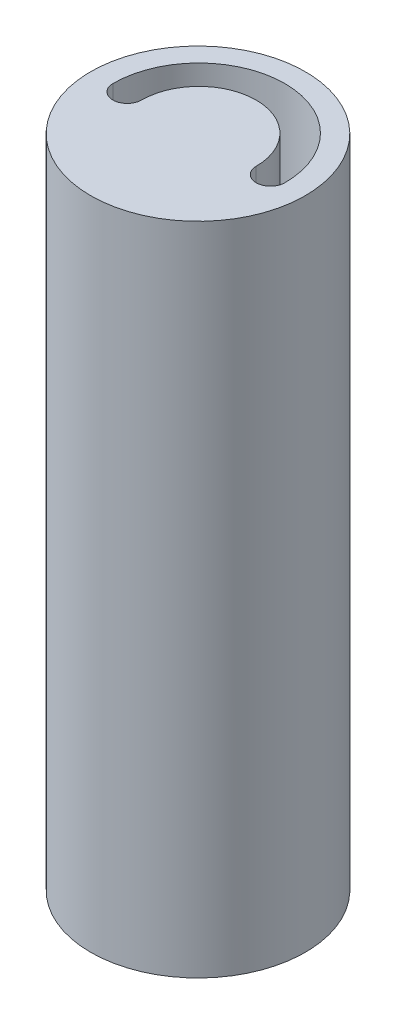
ISO-10303-21;
HEADER;
FILE_DESCRIPTION(('STEP AP214'),'2;1');
FILE_NAME('part.step','',(''),(''),'','','');
FILE_SCHEMA(('AUTOMOTIVE_DESIGN { 1 0 10303 214 1 1 1 1 }'));
ENDSEC;
DATA;
#1=APPLICATION_CONTEXT('core data for automotive mechanical design processes');
#2=APPLICATION_PROTOCOL_DEFINITION('international standard','automotive_design',2000,#1);
#3=PRODUCT_CONTEXT('',#1,'mechanical');
#4=PRODUCT('Part','Part','',(#3));
#5=PRODUCT_RELATED_PRODUCT_CATEGORY('part','',(#4));
#6=PRODUCT_DEFINITION_FORMATION('','',#4);
#7=PRODUCT_DEFINITION_CONTEXT('part definition',#1,'design');
#8=PRODUCT_DEFINITION('design','',#6,#7);
#9=PRODUCT_DEFINITION_SHAPE('','',#8);
#10=(LENGTH_UNIT() NAMED_UNIT(*) SI_UNIT(.MILLI.,.METRE.));
#11=(NAMED_UNIT(*) PLANE_ANGLE_UNIT() SI_UNIT($,.RADIAN.));
#12=(NAMED_UNIT(*) SI_UNIT($,.STERADIAN.) SOLID_ANGLE_UNIT());
#13=UNCERTAINTY_MEASURE_WITH_UNIT(LENGTH_MEASURE(1.E-05),#10,'distance_accuracy_value','');
#14=(GEOMETRIC_REPRESENTATION_CONTEXT(3) GLOBAL_UNCERTAINTY_ASSIGNED_CONTEXT((#13)) GLOBAL_UNIT_ASSIGNED_CONTEXT((#10,
#11,#12)) REPRESENTATION_CONTEXT('',''));
#15=CARTESIAN_POINT('',(0.,0.,0.));
#16=DIRECTION('',(0.,0.,1.));
#17=DIRECTION('',(1.,0.,0.));
#18=AXIS2_PLACEMENT_3D('',#15,#16,#17);
#19=CARTESIAN_POINT('',(0.,-349.6,-28.1));
#20=DIRECTION('',(0.,1.,0.));
#21=DIRECTION('',(0.,0.,1.));
#22=AXIS2_PLACEMENT_3D('',#19,#20,#21);
#23=CYLINDRICAL_SURFACE('',#22,28.1);
#24=CARTESIAN_POINT('',(0.,-349.6,-28.1));
#25=DIRECTION('',(0.,-1.,0.));
#26=DIRECTION('',(0.,0.,-1.));
#27=AXIS2_PLACEMENT_3D('',#24,#25,#26);
#28=CIRCLE('',#27,28.1);
#29=CARTESIAN_POINT('',(0.,-349.6,-56.2));
#30=VERTEX_POINT('',#29);
#31=EDGE_CURVE('E175',#30,#30,#28,.T.);
#32=ORIENTED_EDGE('',*,*,#31,.F.);
#33=EDGE_LOOP('',(#32));
#34=FACE_BOUND('',#33,.T.);
#35=CARTESIAN_POINT('',(0.,-178.1,-28.1));
#36=DIRECTION('',(0.,1.,0.));
#37=DIRECTION('',(0.,0.,1.));
#38=AXIS2_PLACEMENT_3D('',#35,#36,#37);
#39=CIRCLE('',#38,28.1);
#40=CARTESIAN_POINT('',(0.,-178.1,0.));
#41=VERTEX_POINT('',#40);
#42=EDGE_CURVE('E225',#41,#41,#39,.T.);
#43=ORIENTED_EDGE('',*,*,#42,.F.);
#44=EDGE_LOOP('',(#43));
#45=FACE_BOUND('',#44,.T.);
#46=ADVANCED_FACE('F39',(#34,#45),#23,.T.);
#47=CARTESIAN_POINT('',(0.,-349.6,-28.3320788958154));
#48=DIRECTION('',(0.,-1.,0.));
#49=DIRECTION('',(0.,0.,-1.));
#50=AXIS2_PLACEMENT_3D('',#47,#48,#49);
#51=CYLINDRICAL_SURFACE('',#50,15.);
#52=DIRECTION('',(0.,1.,0.));
#53=VECTOR('',#52,1.);
#54=CARTESIAN_POINT('',(-15.,-349.6,-28.3320788958154));
#55=LINE('',#54,#53);
#56=CARTESIAN_POINT('',(-15.,-349.6,-28.3320788958154));
#57=VERTEX_POINT('',#56);
#58=CARTESIAN_POINT('',(-15.,-178.1,-28.3320788958154));
#59=VERTEX_POINT('',#58);
#60=EDGE_CURVE('E115',#57,#59,#55,.T.);
#61=ORIENTED_EDGE('',*,*,#60,.T.);
#62=CARTESIAN_POINT('',(0.,-178.1,-28.3320788958154));
#63=DIRECTION('',(0.,1.,0.));
#64=DIRECTION('',(0.,0.,1.));
#65=AXIS2_PLACEMENT_3D('',#62,#63,#64);
#66=CIRCLE('',#65,15.);
#67=CARTESIAN_POINT('',(15.,-178.1,-28.3320788958154));
#68=VERTEX_POINT('',#67);
#69=EDGE_CURVE('E103',#59,#68,#66,.F.);
#70=ORIENTED_EDGE('',*,*,#69,.T.);
#71=DIRECTION('',(0.,1.,0.));
#72=VECTOR('',#71,1.);
#73=CARTESIAN_POINT('',(15.,-349.6,-28.3320788958154));
#74=LINE('',#73,#72);
#75=CARTESIAN_POINT('',(15.,-349.6,-28.3320788958154));
#76=VERTEX_POINT('',#75);
#77=EDGE_CURVE('E113',#76,#68,#74,.T.);
#78=ORIENTED_EDGE('',*,*,#77,.F.);
#79=CARTESIAN_POINT('',(0.,-349.6,-28.3320788958154));
#80=DIRECTION('',(0.,-1.,0.));
#81=DIRECTION('',(-1.,0.,0.));
#82=AXIS2_PLACEMENT_3D('',#79,#80,#81);
#83=CIRCLE('',#82,15.);
#84=EDGE_CURVE('E124',#57,#76,#83,.T.);
#85=ORIENTED_EDGE('',*,*,#84,.F.);
#86=EDGE_LOOP('',(#61,#70,#78,#85));
#87=FACE_BOUND('',#86,.T.);
#88=ADVANCED_FACE('F111',(#87),#51,.T.);
#89=CARTESIAN_POINT('',(0.,-349.6,-28.3320788958154));
#90=DIRECTION('',(0.,-1.,0.));
#91=DIRECTION('',(0.,0.,-1.));
#92=AXIS2_PLACEMENT_3D('',#89,#90,#91);
#93=CYLINDRICAL_SURFACE('',#92,22.5);
#94=DIRECTION('',(0.,-1.,0.));
#95=VECTOR('',#94,1.);
#96=CARTESIAN_POINT('',(22.5,-349.6,-28.3320788958154));
#97=LINE('',#96,#95);
#98=CARTESIAN_POINT('',(22.5,-178.1,-28.3320788958154));
#99=VERTEX_POINT('',#98);
#100=CARTESIAN_POINT('',(22.5,-349.6,-28.3320788958154));
#101=VERTEX_POINT('',#100);
#102=EDGE_CURVE('E123',#99,#101,#97,.T.);
#103=ORIENTED_EDGE('',*,*,#102,.F.);
#104=CARTESIAN_POINT('',(0.,-178.1,-28.3320788958154));
#105=DIRECTION('',(0.,1.,0.));
#106=DIRECTION('',(0.,0.,1.));
#107=AXIS2_PLACEMENT_3D('',#104,#105,#106);
#108=CIRCLE('',#107,22.5);
#109=CARTESIAN_POINT('',(-22.5,-178.1,-28.3320788958154));
#110=VERTEX_POINT('',#109);
#111=EDGE_CURVE('E53',#99,#110,#108,.T.);
#112=ORIENTED_EDGE('',*,*,#111,.T.);
#113=DIRECTION('',(0.,-1.,0.));
#114=VECTOR('',#113,1.);
#115=CARTESIAN_POINT('',(-22.5,-349.6,-28.3320788958154));
#116=LINE('',#115,#114);
#117=CARTESIAN_POINT('',(-22.5,-349.6,-28.3320788958154));
#118=VERTEX_POINT('',#117);
#119=EDGE_CURVE('E60',#110,#118,#116,.T.);
#120=ORIENTED_EDGE('',*,*,#119,.T.);
#121=CARTESIAN_POINT('',(0.,-349.6,-28.3320788958154));
#122=DIRECTION('',(0.,-1.,0.));
#123=DIRECTION('',(-1.,0.,0.));
#124=AXIS2_PLACEMENT_3D('',#121,#122,#123);
#125=CIRCLE('',#124,22.5);
#126=EDGE_CURVE('E128',#118,#101,#125,.T.);
#127=ORIENTED_EDGE('',*,*,#126,.T.);
#128=EDGE_LOOP('',(#103,#112,#120,#127));
#129=FACE_BOUND('',#128,.T.);
#130=ADVANCED_FACE('F219',(#129),#93,.F.);
#131=CARTESIAN_POINT('',(-18.75,-24.6,-28.3320788958154));
#132=DIRECTION('',(0.,-1.,0.));
#133=DIRECTION('',(0.,0.,-1.));
#134=AXIS2_PLACEMENT_3D('',#131,#132,#133);
#135=CYLINDRICAL_SURFACE('',#134,3.75);
#136=CARTESIAN_POINT('',(-18.75,-178.1,-28.3320788958154));
#137=DIRECTION('',(0.,1.,0.));
#138=DIRECTION('',(0.,0.,1.));
#139=AXIS2_PLACEMENT_3D('',#136,#137,#138);
#140=CIRCLE('',#139,3.75);
#141=EDGE_CURVE('E117',#59,#110,#140,.F.);
#142=ORIENTED_EDGE('',*,*,#141,.F.);
#143=ORIENTED_EDGE('',*,*,#60,.F.);
#144=CARTESIAN_POINT('',(-18.75,-349.6,-28.3320788958154));
#145=DIRECTION('',(0.,-1.,0.));
#146=DIRECTION('',(0.,0.,-1.));
#147=AXIS2_PLACEMENT_3D('',#144,#145,#146);
#148=CIRCLE('',#147,3.75);
#149=EDGE_CURVE('E233',#57,#118,#148,.T.);
#150=ORIENTED_EDGE('',*,*,#149,.T.);
#151=ORIENTED_EDGE('',*,*,#119,.F.);
#152=EDGE_LOOP('',(#142,#143,#150,#151));
#153=FACE_BOUND('',#152,.T.);
#154=ADVANCED_FACE('F239',(#153),#135,.F.);
#155=CARTESIAN_POINT('',(18.75,-24.6,-28.3320788958154));
#156=DIRECTION('',(0.,-1.,0.));
#157=DIRECTION('',(0.,0.,-1.));
#158=AXIS2_PLACEMENT_3D('',#155,#156,#157);
#159=CYLINDRICAL_SURFACE('',#158,3.75);
#160=CARTESIAN_POINT('',(18.75,-178.1,-28.3320788958154));
#161=DIRECTION('',(0.,1.,0.));
#162=DIRECTION('',(0.,0.,1.));
#163=AXIS2_PLACEMENT_3D('',#160,#161,#162);
#164=CIRCLE('',#163,3.75);
#165=EDGE_CURVE('E11',#99,#68,#164,.F.);
#166=ORIENTED_EDGE('',*,*,#165,.F.);
#167=ORIENTED_EDGE('',*,*,#102,.T.);
#168=CARTESIAN_POINT('',(18.75,-349.6,-28.3320788958154));
#169=DIRECTION('',(0.,-1.,0.));
#170=DIRECTION('',(0.,0.,-1.));
#171=AXIS2_PLACEMENT_3D('',#168,#169,#170);
#172=CIRCLE('',#171,3.75);
#173=EDGE_CURVE('E121',#101,#76,#172,.T.);
#174=ORIENTED_EDGE('',*,*,#173,.T.);
#175=ORIENTED_EDGE('',*,*,#77,.T.);
#176=EDGE_LOOP('',(#166,#167,#174,#175));
#177=FACE_BOUND('',#176,.T.);
#178=ADVANCED_FACE('F119',(#177),#159,.F.);
#179=CARTESIAN_POINT('',(0.,-349.6,-28.1));
#180=DIRECTION('',(0.,-1.,0.));
#181=DIRECTION('',(0.,0.,-1.));
#182=AXIS2_PLACEMENT_3D('',#179,#180,#181);
#183=PLANE('',#182);
#184=ORIENTED_EDGE('',*,*,#173,.F.);
#185=ORIENTED_EDGE('',*,*,#126,.F.);
#186=ORIENTED_EDGE('',*,*,#149,.F.);
#187=ORIENTED_EDGE('',*,*,#84,.T.);
#188=EDGE_LOOP('',(#184,#185,#186,#187));
#189=FACE_BOUND('',#188,.T.);
#190=CARTESIAN_POINT('',(0.,-349.6,-28.3320788958154));
#191=DIRECTION('',(0.,-1.,0.));
#192=DIRECTION('',(0.,0.,-1.));
#193=AXIS2_PLACEMENT_3D('',#190,#191,#192);
#194=CIRCLE('',#193,6.025);
#195=CARTESIAN_POINT('',(0.,-349.6,-34.3570788958154));
#196=VERTEX_POINT('',#195);
#197=EDGE_CURVE('E138',#196,#196,#194,.T.);
#198=ORIENTED_EDGE('',*,*,#197,.F.);
#199=EDGE_LOOP('',(#198));
#200=FACE_BOUND('',#199,.T.);
#201=ORIENTED_EDGE('',*,*,#31,.T.);
#202=EDGE_LOOP('',(#201));
#203=FACE_BOUND('',#202,.T.);
#204=ADVANCED_FACE('F241',(#189,#200,#203),#183,.T.);
#205=CARTESIAN_POINT('',(0.,-349.5,-28.3320788958154));
#206=DIRECTION('',(0.,-1.,0.));
#207=DIRECTION('',(0.,0.,-1.));
#208=AXIS2_PLACEMENT_3D('',#205,#206,#207);
#209=PLANE('',#208);
#210=CARTESIAN_POINT('',(0.,-349.5,-28.3320788958154));
#211=DIRECTION('',(0.,-1.,0.));
#212=DIRECTION('',(0.,0.,-1.));
#213=AXIS2_PLACEMENT_3D('',#210,#211,#212);
#214=CIRCLE('',#213,6.025);
#215=CARTESIAN_POINT('',(0.,-349.5,-34.3570788958154));
#216=VERTEX_POINT('',#215);
#217=EDGE_CURVE('E139',#216,#216,#214,.T.);
#218=ORIENTED_EDGE('',*,*,#217,.T.);
#219=EDGE_LOOP('',(#218));
#220=FACE_BOUND('',#219,.T.);
#221=CARTESIAN_POINT('',(0.,-349.5,-28.3320788958154));
#222=DIRECTION('',(0.,-1.,0.));
#223=DIRECTION('',(0.,0.,-1.));
#224=AXIS2_PLACEMENT_3D('',#221,#222,#223);
#225=CIRCLE('',#224,3.);
#226=CARTESIAN_POINT('',(0.,-349.5,-31.3320788958154));
#227=VERTEX_POINT('',#226);
#228=EDGE_CURVE('E143',#227,#227,#225,.F.);
#229=ORIENTED_EDGE('',*,*,#228,.T.);
#230=EDGE_LOOP('',(#229));
#231=FACE_BOUND('',#230,.T.);
#232=ADVANCED_FACE('F195',(#220,#231),#209,.T.);
#233=CARTESIAN_POINT('',(0.,-349.5,-28.3320788958154));
#234=DIRECTION('',(0.,-1.,0.));
#235=DIRECTION('',(0.,0.,-1.));
#236=AXIS2_PLACEMENT_3D('',#233,#234,#235);
#237=CYLINDRICAL_SURFACE('',#236,6.025);
#238=ORIENTED_EDGE('',*,*,#217,.F.);
#239=EDGE_LOOP('',(#238));
#240=FACE_BOUND('',#239,.T.);
#241=ORIENTED_EDGE('',*,*,#197,.T.);
#242=EDGE_LOOP('',(#241));
#243=FACE_BOUND('',#242,.T.);
#244=ADVANCED_FACE('F252',(#240,#243),#237,.F.);
#245=CARTESIAN_POINT('',(0.,-348.6,-28.3320788958154));
#246=DIRECTION('',(0.,-1.,0.));
#247=DIRECTION('',(0.,0.,-1.));
#248=AXIS2_PLACEMENT_3D('',#245,#246,#247);
#249=PLANE('',#248);
#250=DIRECTION('',(-1.,0.,0.));
#251=VECTOR('',#250,1.);
#252=CARTESIAN_POINT('',(1.6583123951777,-348.6,-30.8320788958154));
#253=LINE('',#252,#251);
#254=CARTESIAN_POINT('',(1.6583123951777,-348.6,-30.8320788958154));
#255=VERTEX_POINT('',#254);
#256=CARTESIAN_POINT('',(-1.6583123951777,-348.6,-30.8320788958154));
#257=VERTEX_POINT('',#256);
#258=EDGE_CURVE('E151',#255,#257,#253,.T.);
#259=ORIENTED_EDGE('',*,*,#258,.T.);
#260=CARTESIAN_POINT('',(0.,-348.6,-28.3320788958154));
#261=DIRECTION('',(0.,-1.,0.));
#262=DIRECTION('',(0.,0.,-1.));
#263=AXIS2_PLACEMENT_3D('',#260,#261,#262);
#264=CIRCLE('',#263,3.);
#265=EDGE_CURVE('E147',#257,#255,#264,.T.);
#266=ORIENTED_EDGE('',*,*,#265,.T.);
#267=EDGE_LOOP('',(#259,#266));
#268=FACE_BOUND('',#267,.T.);
#269=ADVANCED_FACE('F211',(#268),#249,.T.);
#270=CARTESIAN_POINT('',(1.6583123951777,-339.6,-30.8320788958154));
#271=DIRECTION('',(0.,0.,-1.));
#272=DIRECTION('',(-1.,0.,0.));
#273=AXIS2_PLACEMENT_3D('',#270,#271,#272);
#274=PLANE('',#273);
#275=ORIENTED_EDGE('',*,*,#258,.F.);
#276=DIRECTION('',(0.,-1.,0.));
#277=VECTOR('',#276,1.);
#278=CARTESIAN_POINT('',(1.6583123951777,-339.6,-30.8320788958154));
#279=LINE('',#278,#277);
#280=CARTESIAN_POINT('',(1.6583123951777,-339.6,-30.8320788958154));
#281=VERTEX_POINT('',#280);
#282=EDGE_CURVE('E171',#281,#255,#279,.T.);
#283=ORIENTED_EDGE('',*,*,#282,.F.);
#284=DIRECTION('',(1.,0.,0.));
#285=VECTOR('',#284,1.);
#286=CARTESIAN_POINT('',(1.6583123951777,-339.6,-30.8320788958154));
#287=LINE('',#286,#285);
#288=CARTESIAN_POINT('',(-1.6583123951777,-339.6,-30.8320788958154));
#289=VERTEX_POINT('',#288);
#290=EDGE_CURVE('E166',#289,#281,#287,.T.);
#291=ORIENTED_EDGE('',*,*,#290,.F.);
#292=DIRECTION('',(0.,-1.,0.));
#293=VECTOR('',#292,1.);
#294=CARTESIAN_POINT('',(-1.6583123951777,-339.6,-30.8320788958154));
#295=LINE('',#294,#293);
#296=EDGE_CURVE('E176',#289,#257,#295,.T.);
#297=ORIENTED_EDGE('',*,*,#296,.T.);
#298=EDGE_LOOP('',(#275,#283,#291,#297));
#299=FACE_BOUND('',#298,.T.);
#300=ADVANCED_FACE('F258',(#299),#274,.F.);
#301=CARTESIAN_POINT('',(0.,-339.6,-28.3320788958154));
#302=DIRECTION('',(0.,-1.,0.));
#303=DIRECTION('',(0.,0.,-1.));
#304=AXIS2_PLACEMENT_3D('',#301,#302,#303);
#305=PLANE('',#304);
#306=CARTESIAN_POINT('',(0.,-339.6,-28.3320788958154));
#307=DIRECTION('',(0.,-1.,0.));
#308=DIRECTION('',(0.,0.,-1.));
#309=AXIS2_PLACEMENT_3D('',#306,#307,#308);
#310=CIRCLE('',#309,3.);
#311=CARTESIAN_POINT('',(1.6583123951777,-339.6,-25.8320788958154));
#312=VERTEX_POINT('',#311);
#313=EDGE_CURVE('E154',#281,#312,#310,.T.);
#314=ORIENTED_EDGE('',*,*,#313,.T.);
#315=DIRECTION('',(-1.,0.,0.));
#316=VECTOR('',#315,1.);
#317=CARTESIAN_POINT('',(1.6583123951777,-339.6,-25.8320788958154));
#318=LINE('',#317,#316);
#319=CARTESIAN_POINT('',(-1.6583123951777,-339.6,-25.8320788958154));
#320=VERTEX_POINT('',#319);
#321=EDGE_CURVE('E158',#312,#320,#318,.T.);
#322=ORIENTED_EDGE('',*,*,#321,.T.);
#323=CARTESIAN_POINT('',(0.,-339.6,-28.3320788958154));
#324=DIRECTION('',(0.,-1.,0.));
#325=DIRECTION('',(0.,0.,-1.));
#326=AXIS2_PLACEMENT_3D('',#323,#324,#325);
#327=CIRCLE('',#326,3.);
#328=EDGE_CURVE('E162',#320,#289,#327,.T.);
#329=ORIENTED_EDGE('',*,*,#328,.T.);
#330=ORIENTED_EDGE('',*,*,#290,.T.);
#331=EDGE_LOOP('',(#314,#322,#329,#330));
#332=FACE_BOUND('',#331,.T.);
#333=ADVANCED_FACE('F260',(#332),#305,.T.);
#334=CARTESIAN_POINT('',(1.6583123951777,-339.6,-25.8320788958154));
#335=DIRECTION('',(0.,0.,1.));
#336=DIRECTION('',(1.,0.,0.));
#337=AXIS2_PLACEMENT_3D('',#334,#335,#336);
#338=PLANE('',#337);
#339=DIRECTION('',(1.,0.,0.));
#340=VECTOR('',#339,1.);
#341=CARTESIAN_POINT('',(1.6583123951777,-348.6,-25.8320788958154));
#342=LINE('',#341,#340);
#343=CARTESIAN_POINT('',(-1.6583123951777,-348.6,-25.8320788958154));
#344=VERTEX_POINT('',#343);
#345=CARTESIAN_POINT('',(1.65831239517772,-348.6,-25.8320788958154));
#346=VERTEX_POINT('',#345);
#347=EDGE_CURVE('E47',#344,#346,#342,.T.);
#348=ORIENTED_EDGE('',*,*,#347,.F.);
#349=DIRECTION('',(0.,-1.,0.));
#350=VECTOR('',#349,1.);
#351=CARTESIAN_POINT('',(-1.6583123951777,-339.6,-25.8320788958154));
#352=LINE('',#351,#350);
#353=EDGE_CURVE('E180',#320,#344,#352,.T.);
#354=ORIENTED_EDGE('',*,*,#353,.F.);
#355=ORIENTED_EDGE('',*,*,#321,.F.);
#356=DIRECTION('',(0.,-1.,0.));
#357=VECTOR('',#356,1.);
#358=CARTESIAN_POINT('',(1.6583123951777,-339.6,-25.8320788958154));
#359=LINE('',#358,#357);
#360=EDGE_CURVE('E170',#312,#346,#359,.T.);
#361=ORIENTED_EDGE('',*,*,#360,.T.);
#362=EDGE_LOOP('',(#348,#354,#355,#361));
#363=FACE_BOUND('',#362,.T.);
#364=ADVANCED_FACE('F208',(#363),#338,.F.);
#365=ORIENTED_EDGE('',*,*,#347,.T.);
#366=EDGE_CURVE('E150',#346,#344,#264,.T.);
#367=ORIENTED_EDGE('',*,*,#366,.T.);
#368=EDGE_LOOP('',(#365,#367));
#369=FACE_BOUND('',#368,.T.);
#370=ADVANCED_FACE('F199',(#369),#249,.T.);
#371=CARTESIAN_POINT('',(0.,-339.6,-28.3320788958154));
#372=DIRECTION('',(0.,-1.,0.));
#373=DIRECTION('',(0.,0.,-1.));
#374=AXIS2_PLACEMENT_3D('',#371,#372,#373);
#375=CYLINDRICAL_SURFACE('',#374,3.);
#376=ORIENTED_EDGE('',*,*,#366,.F.);
#377=ORIENTED_EDGE('',*,*,#360,.F.);
#378=ORIENTED_EDGE('',*,*,#313,.F.);
#379=ORIENTED_EDGE('',*,*,#282,.T.);
#380=ORIENTED_EDGE('',*,*,#265,.F.);
#381=ORIENTED_EDGE('',*,*,#296,.F.);
#382=ORIENTED_EDGE('',*,*,#328,.F.);
#383=ORIENTED_EDGE('',*,*,#353,.T.);
#384=EDGE_LOOP('',(#376,#377,#378,#379,#380,#381,#382,#383));
#385=FACE_BOUND('',#384,.T.);
#386=ORIENTED_EDGE('',*,*,#228,.F.);
#387=EDGE_LOOP('',(#386));
#388=FACE_BOUND('',#387,.T.);
#389=ADVANCED_FACE('F197',(#385,#388),#375,.F.);
#390=CARTESIAN_POINT('',(0.,-178.1,-28.1));
#391=DIRECTION('',(0.,1.,0.));
#392=DIRECTION('',(0.,0.,1.));
#393=AXIS2_PLACEMENT_3D('',#390,#391,#392);
#394=PLANE('',#393);
#395=ORIENTED_EDGE('',*,*,#42,.T.);
#396=EDGE_LOOP('',(#395));
#397=FACE_BOUND('',#396,.T.);
#398=ORIENTED_EDGE('',*,*,#141,.T.);
#399=ORIENTED_EDGE('',*,*,#111,.F.);
#400=ORIENTED_EDGE('',*,*,#165,.T.);
#401=ORIENTED_EDGE('',*,*,#69,.F.);
#402=EDGE_LOOP('',(#398,#399,#400,#401));
#403=FACE_BOUND('',#402,.T.);
#404=ADVANCED_FACE('F102',(#397,#403),#394,.T.);
#405=CLOSED_SHELL('',(#46,#88,#130,#154,#178,#204,#232,#244,#269,#300,#333,#364,#370,#389,#404));
#406=MANIFOLD_SOLID_BREP('B2',#405);
#407=ADVANCED_BREP_SHAPE_REPRESENTATION('',(#18,#406),#14);
#408=SHAPE_DEFINITION_REPRESENTATION(#9,#407);
ENDSEC;
END-ISO-10303-21;
